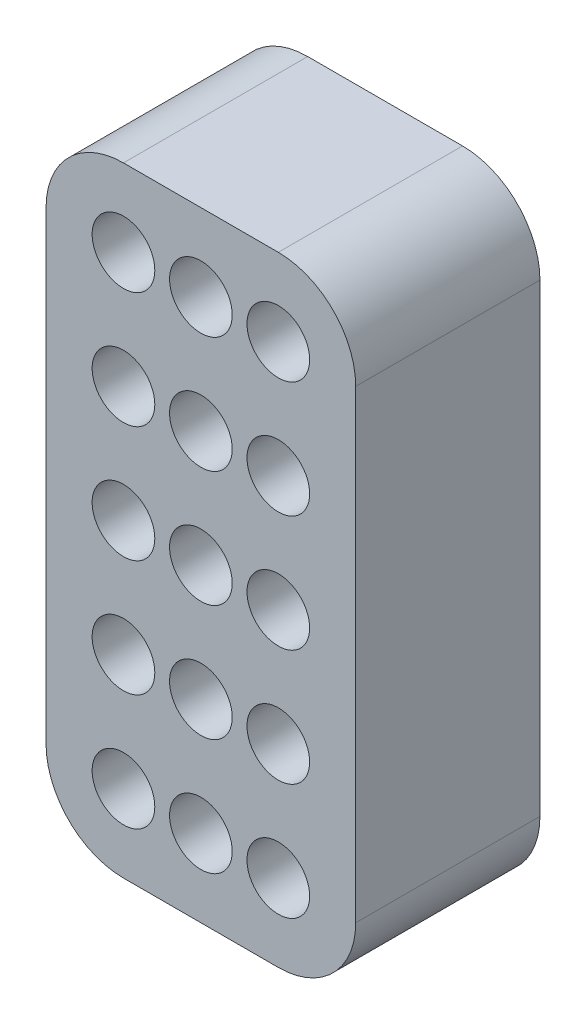
ISO-10303-21;
HEADER;
FILE_DESCRIPTION(('STEP AP214'),'2;1');
FILE_NAME('part.step','',(''),(''),'','','');
FILE_SCHEMA(('AUTOMOTIVE_DESIGN { 1 0 10303 214 1 1 1 1 }'));
ENDSEC;
DATA;
#1=APPLICATION_CONTEXT('core data for automotive mechanical design processes');
#2=APPLICATION_PROTOCOL_DEFINITION('international standard','automotive_design',2000,#1);
#3=PRODUCT_CONTEXT('',#1,'mechanical');
#4=PRODUCT('Part','Part','',(#3));
#5=PRODUCT_RELATED_PRODUCT_CATEGORY('part','',(#4));
#6=PRODUCT_DEFINITION_FORMATION('','',#4);
#7=PRODUCT_DEFINITION_CONTEXT('part definition',#1,'design');
#8=PRODUCT_DEFINITION('design','',#6,#7);
#9=PRODUCT_DEFINITION_SHAPE('','',#8);
#10=(LENGTH_UNIT() NAMED_UNIT(*) SI_UNIT(.MILLI.,.METRE.));
#11=(NAMED_UNIT(*) PLANE_ANGLE_UNIT() SI_UNIT($,.RADIAN.));
#12=(NAMED_UNIT(*) SI_UNIT($,.STERADIAN.) SOLID_ANGLE_UNIT());
#13=UNCERTAINTY_MEASURE_WITH_UNIT(LENGTH_MEASURE(1.E-05),#10,'distance_accuracy_value','');
#14=(GEOMETRIC_REPRESENTATION_CONTEXT(3) GLOBAL_UNCERTAINTY_ASSIGNED_CONTEXT((#13)) GLOBAL_UNIT_ASSIGNED_CONTEXT((#10,
#11,#12)) REPRESENTATION_CONTEXT('',''));
#15=CARTESIAN_POINT('',(0.,0.,0.));
#16=DIRECTION('',(0.,0.,1.));
#17=DIRECTION('',(1.,0.,0.));
#18=AXIS2_PLACEMENT_3D('',#15,#16,#17);
#19=CARTESIAN_POINT('',(-2.,3.,1.54945714564995));
#20=DIRECTION('',(0.,0.,-1.));
#21=DIRECTION('',(-1.,0.,0.));
#22=AXIS2_PLACEMENT_3D('',#19,#20,#21);
#23=PLANE('',#22);
#24=CARTESIAN_POINT('',(-2.,3.,1.54945714564995));
#25=DIRECTION('',(0.,0.,1.));
#26=DIRECTION('',(1.,0.,0.));
#27=AXIS2_PLACEMENT_3D('',#24,#25,#26);
#28=CIRCLE('',#27,0.809369135669028);
#29=CARTESIAN_POINT('',(-1.19063086433097,3.,1.54945714564995));
#30=VERTEX_POINT('',#29);
#31=EDGE_CURVE('E20',#30,#30,#28,.T.);
#32=ORIENTED_EDGE('',*,*,#31,.T.);
#33=EDGE_LOOP('',(#32));
#34=FACE_BOUND('',#33,.T.);
#35=ADVANCED_FACE('F17',(#34),#23,.F.);
#36=CARTESIAN_POINT('',(-2.,-3.,1.54945714564995));
#37=DIRECTION('',(0.,0.,-1.));
#38=DIRECTION('',(-1.,0.,0.));
#39=AXIS2_PLACEMENT_3D('',#36,#37,#38);
#40=PLANE('',#39);
#41=CARTESIAN_POINT('',(-2.,-3.,1.54945714564995));
#42=DIRECTION('',(0.,0.,1.));
#43=DIRECTION('',(1.,0.,0.));
#44=AXIS2_PLACEMENT_3D('',#41,#42,#43);
#45=CIRCLE('',#44,0.809369135669028);
#46=CARTESIAN_POINT('',(-1.19063086433097,-3.,1.54945714564995));
#47=VERTEX_POINT('',#46);
#48=EDGE_CURVE('E218',#47,#47,#45,.T.);
#49=ORIENTED_EDGE('',*,*,#48,.T.);
#50=EDGE_LOOP('',(#49));
#51=FACE_BOUND('',#50,.T.);
#52=ADVANCED_FACE('F341',(#51),#40,.F.);
#53=CARTESIAN_POINT('',(0.,6.,1.54945714564995));
#54=DIRECTION('',(0.,0.,-1.));
#55=DIRECTION('',(-1.,0.,0.));
#56=AXIS2_PLACEMENT_3D('',#53,#54,#55);
#57=PLANE('',#56);
#58=CARTESIAN_POINT('',(0.,6.,1.54945714564995));
#59=DIRECTION('',(0.,0.,1.));
#60=DIRECTION('',(1.,0.,0.));
#61=AXIS2_PLACEMENT_3D('',#58,#59,#60);
#62=CIRCLE('',#61,0.809369135669028);
#63=CARTESIAN_POINT('',(0.809369135669033,6.,1.54945714564995));
#64=VERTEX_POINT('',#63);
#65=EDGE_CURVE('E216',#64,#64,#62,.T.);
#66=ORIENTED_EDGE('',*,*,#65,.T.);
#67=EDGE_LOOP('',(#66));
#68=FACE_BOUND('',#67,.T.);
#69=ADVANCED_FACE('F338',(#68),#57,.F.);
#70=CARTESIAN_POINT('',(0.,0.,1.54945714564995));
#71=DIRECTION('',(0.,0.,-1.));
#72=DIRECTION('',(-1.,0.,0.));
#73=AXIS2_PLACEMENT_3D('',#70,#71,#72);
#74=PLANE('',#73);
#75=CARTESIAN_POINT('',(0.,0.,1.54945714564995));
#76=DIRECTION('',(0.,0.,1.));
#77=DIRECTION('',(1.,0.,0.));
#78=AXIS2_PLACEMENT_3D('',#75,#76,#77);
#79=CIRCLE('',#78,0.809369135669028);
#80=CARTESIAN_POINT('',(0.809369135669033,0.,1.54945714564995));
#81=VERTEX_POINT('',#80);
#82=EDGE_CURVE('E213',#81,#81,#79,.T.);
#83=ORIENTED_EDGE('',*,*,#82,.T.);
#84=EDGE_LOOP('',(#83));
#85=FACE_BOUND('',#84,.T.);
#86=ADVANCED_FACE('F340',(#85),#74,.F.);
#87=CARTESIAN_POINT('',(0.,-6.,1.54945714564995));
#88=DIRECTION('',(0.,0.,-1.));
#89=DIRECTION('',(-1.,0.,0.));
#90=AXIS2_PLACEMENT_3D('',#87,#88,#89);
#91=PLANE('',#90);
#92=CARTESIAN_POINT('',(0.,-6.,1.54945714564995));
#93=DIRECTION('',(0.,0.,1.));
#94=DIRECTION('',(1.,0.,0.));
#95=AXIS2_PLACEMENT_3D('',#92,#93,#94);
#96=CIRCLE('',#95,0.809369135669028);
#97=CARTESIAN_POINT('',(0.809369135669031,-6.,1.54945714564995));
#98=VERTEX_POINT('',#97);
#99=EDGE_CURVE('E210',#98,#98,#96,.T.);
#100=ORIENTED_EDGE('',*,*,#99,.T.);
#101=EDGE_LOOP('',(#100));
#102=FACE_BOUND('',#101,.T.);
#103=ADVANCED_FACE('F347',(#102),#91,.F.);
#104=CARTESIAN_POINT('',(2.,3.,1.54945714564995));
#105=DIRECTION('',(0.,0.,-1.));
#106=DIRECTION('',(-1.,0.,0.));
#107=AXIS2_PLACEMENT_3D('',#104,#105,#106);
#108=PLANE('',#107);
#109=CARTESIAN_POINT('',(2.,3.,1.54945714564995));
#110=DIRECTION('',(0.,0.,1.));
#111=DIRECTION('',(1.,0.,0.));
#112=AXIS2_PLACEMENT_3D('',#109,#110,#111);
#113=CIRCLE('',#112,0.809369135669028);
#114=CARTESIAN_POINT('',(2.80936913566903,3.,1.54945714564995));
#115=VERTEX_POINT('',#114);
#116=EDGE_CURVE('E207',#115,#115,#113,.T.);
#117=ORIENTED_EDGE('',*,*,#116,.T.);
#118=EDGE_LOOP('',(#117));
#119=FACE_BOUND('',#118,.T.);
#120=ADVANCED_FACE('F353',(#119),#108,.F.);
#121=CARTESIAN_POINT('',(2.,-3.,1.54945714564995));
#122=DIRECTION('',(0.,0.,-1.));
#123=DIRECTION('',(-1.,0.,0.));
#124=AXIS2_PLACEMENT_3D('',#121,#122,#123);
#125=PLANE('',#124);
#126=CARTESIAN_POINT('',(2.,-3.,1.54945714564995));
#127=DIRECTION('',(0.,0.,1.));
#128=DIRECTION('',(1.,0.,0.));
#129=AXIS2_PLACEMENT_3D('',#126,#127,#128);
#130=CIRCLE('',#129,0.809369135669028);
#131=CARTESIAN_POINT('',(2.80936913566903,-3.,1.54945714564995));
#132=VERTEX_POINT('',#131);
#133=EDGE_CURVE('E204',#132,#132,#130,.T.);
#134=ORIENTED_EDGE('',*,*,#133,.T.);
#135=EDGE_LOOP('',(#134));
#136=FACE_BOUND('',#135,.T.);
#137=ADVANCED_FACE('F357',(#136),#125,.F.);
#138=CARTESIAN_POINT('',(2.,-6.,1.54945714564995));
#139=DIRECTION('',(0.,0.,-1.));
#140=DIRECTION('',(-1.,0.,0.));
#141=AXIS2_PLACEMENT_3D('',#138,#139,#140);
#142=PLANE('',#141);
#143=CARTESIAN_POINT('',(2.,-6.,1.54945714564995));
#144=DIRECTION('',(0.,0.,1.));
#145=DIRECTION('',(1.,0.,0.));
#146=AXIS2_PLACEMENT_3D('',#143,#144,#145);
#147=CIRCLE('',#146,0.809369135669028);
#148=CARTESIAN_POINT('',(2.80936913566903,-6.,1.54945714564995));
#149=VERTEX_POINT('',#148);
#150=EDGE_CURVE('E201',#149,#149,#147,.T.);
#151=ORIENTED_EDGE('',*,*,#150,.T.);
#152=EDGE_LOOP('',(#151));
#153=FACE_BOUND('',#152,.T.);
#154=ADVANCED_FACE('F361',(#153),#142,.F.);
#155=CARTESIAN_POINT('',(2.,0.,1.54945714564995));
#156=DIRECTION('',(0.,0.,-1.));
#157=DIRECTION('',(-1.,0.,0.));
#158=AXIS2_PLACEMENT_3D('',#155,#156,#157);
#159=PLANE('',#158);
#160=CARTESIAN_POINT('',(2.,0.,1.54945714564995));
#161=DIRECTION('',(0.,0.,1.));
#162=DIRECTION('',(1.,0.,0.));
#163=AXIS2_PLACEMENT_3D('',#160,#161,#162);
#164=CIRCLE('',#163,0.809369135669028);
#165=CARTESIAN_POINT('',(2.80936913566903,0.,1.54945714564995));
#166=VERTEX_POINT('',#165);
#167=EDGE_CURVE('E198',#166,#166,#164,.T.);
#168=ORIENTED_EDGE('',*,*,#167,.T.);
#169=EDGE_LOOP('',(#168));
#170=FACE_BOUND('',#169,.T.);
#171=ADVANCED_FACE('F365',(#170),#159,.F.);
#172=CARTESIAN_POINT('',(2.,6.,1.54945714564995));
#173=DIRECTION('',(0.,0.,-1.));
#174=DIRECTION('',(-1.,0.,0.));
#175=AXIS2_PLACEMENT_3D('',#172,#173,#174);
#176=PLANE('',#175);
#177=CARTESIAN_POINT('',(2.,6.,1.54945714564995));
#178=DIRECTION('',(0.,0.,1.));
#179=DIRECTION('',(1.,0.,0.));
#180=AXIS2_PLACEMENT_3D('',#177,#178,#179);
#181=CIRCLE('',#180,0.809369135669028);
#182=CARTESIAN_POINT('',(2.80936913566903,6.,1.54945714564995));
#183=VERTEX_POINT('',#182);
#184=EDGE_CURVE('E195',#183,#183,#181,.T.);
#185=ORIENTED_EDGE('',*,*,#184,.T.);
#186=EDGE_LOOP('',(#185));
#187=FACE_BOUND('',#186,.T.);
#188=ADVANCED_FACE('F369',(#187),#176,.F.);
#189=CARTESIAN_POINT('',(0.,-3.,1.54945714564995));
#190=DIRECTION('',(0.,0.,-1.));
#191=DIRECTION('',(-1.,0.,0.));
#192=AXIS2_PLACEMENT_3D('',#189,#190,#191);
#193=PLANE('',#192);
#194=CARTESIAN_POINT('',(0.,-3.,1.54945714564995));
#195=DIRECTION('',(0.,0.,1.));
#196=DIRECTION('',(1.,0.,0.));
#197=AXIS2_PLACEMENT_3D('',#194,#195,#196);
#198=CIRCLE('',#197,0.809369135669028);
#199=CARTESIAN_POINT('',(0.809369135669033,-3.,1.54945714564995));
#200=VERTEX_POINT('',#199);
#201=EDGE_CURVE('E192',#200,#200,#198,.T.);
#202=ORIENTED_EDGE('',*,*,#201,.T.);
#203=EDGE_LOOP('',(#202));
#204=FACE_BOUND('',#203,.T.);
#205=ADVANCED_FACE('F373',(#204),#193,.F.);
#206=CARTESIAN_POINT('',(0.,3.,1.54945714564995));
#207=DIRECTION('',(0.,0.,-1.));
#208=DIRECTION('',(-1.,0.,0.));
#209=AXIS2_PLACEMENT_3D('',#206,#207,#208);
#210=PLANE('',#209);
#211=CARTESIAN_POINT('',(0.,3.,1.54945714564995));
#212=DIRECTION('',(0.,0.,1.));
#213=DIRECTION('',(1.,0.,0.));
#214=AXIS2_PLACEMENT_3D('',#211,#212,#213);
#215=CIRCLE('',#214,0.809369135669028);
#216=CARTESIAN_POINT('',(0.809369135669033,3.,1.54945714564995));
#217=VERTEX_POINT('',#216);
#218=EDGE_CURVE('E189',#217,#217,#215,.T.);
#219=ORIENTED_EDGE('',*,*,#218,.T.);
#220=EDGE_LOOP('',(#219));
#221=FACE_BOUND('',#220,.T.);
#222=ADVANCED_FACE('F377',(#221),#210,.F.);
#223=CARTESIAN_POINT('',(-2.,-6.,1.54945714564995));
#224=DIRECTION('',(0.,0.,-1.));
#225=DIRECTION('',(-1.,0.,0.));
#226=AXIS2_PLACEMENT_3D('',#223,#224,#225);
#227=PLANE('',#226);
#228=CARTESIAN_POINT('',(-2.,-6.,1.54945714564995));
#229=DIRECTION('',(0.,0.,1.));
#230=DIRECTION('',(1.,0.,0.));
#231=AXIS2_PLACEMENT_3D('',#228,#229,#230);
#232=CIRCLE('',#231,0.809369135669028);
#233=CARTESIAN_POINT('',(-1.19063086433097,-6.,1.54945714564995));
#234=VERTEX_POINT('',#233);
#235=EDGE_CURVE('E186',#234,#234,#232,.T.);
#236=ORIENTED_EDGE('',*,*,#235,.T.);
#237=EDGE_LOOP('',(#236));
#238=FACE_BOUND('',#237,.T.);
#239=ADVANCED_FACE('F381',(#238),#227,.F.);
#240=CARTESIAN_POINT('',(-2.,0.,1.54945714564995));
#241=DIRECTION('',(0.,0.,-1.));
#242=DIRECTION('',(-1.,0.,0.));
#243=AXIS2_PLACEMENT_3D('',#240,#241,#242);
#244=PLANE('',#243);
#245=CARTESIAN_POINT('',(-2.,0.,1.54945714564995));
#246=DIRECTION('',(0.,0.,1.));
#247=DIRECTION('',(1.,0.,0.));
#248=AXIS2_PLACEMENT_3D('',#245,#246,#247);
#249=CIRCLE('',#248,0.809369135669028);
#250=CARTESIAN_POINT('',(-1.19063086433097,0.,1.54945714564995));
#251=VERTEX_POINT('',#250);
#252=EDGE_CURVE('E183',#251,#251,#249,.T.);
#253=ORIENTED_EDGE('',*,*,#252,.T.);
#254=EDGE_LOOP('',(#253));
#255=FACE_BOUND('',#254,.T.);
#256=ADVANCED_FACE('F240',(#255),#244,.F.);
#257=CARTESIAN_POINT('',(-2.,6.,1.54945714564995));
#258=DIRECTION('',(0.,0.,-1.));
#259=DIRECTION('',(-1.,0.,0.));
#260=AXIS2_PLACEMENT_3D('',#257,#258,#259);
#261=PLANE('',#260);
#262=CARTESIAN_POINT('',(-2.,6.,1.54945714564995));
#263=DIRECTION('',(0.,0.,1.));
#264=DIRECTION('',(1.,0.,0.));
#265=AXIS2_PLACEMENT_3D('',#262,#263,#264);
#266=CIRCLE('',#265,0.809369135669028);
#267=CARTESIAN_POINT('',(-1.19063086433097,6.,1.54945714564995));
#268=VERTEX_POINT('',#267);
#269=EDGE_CURVE('E180',#268,#268,#266,.T.);
#270=ORIENTED_EDGE('',*,*,#269,.T.);
#271=EDGE_LOOP('',(#270));
#272=FACE_BOUND('',#271,.T.);
#273=ADVANCED_FACE('F229',(#272),#261,.F.);
#274=CARTESIAN_POINT('',(-2.,3.,1.54945714564995));
#275=DIRECTION('',(0.,0.,1.));
#276=DIRECTION('',(1.,0.,0.));
#277=AXIS2_PLACEMENT_3D('',#274,#275,#276);
#278=CYLINDRICAL_SURFACE('',#277,0.809369135669028);
#279=CARTESIAN_POINT('',(-2.,3.,4.75904305856717));
#280=DIRECTION('',(0.,0.,1.));
#281=DIRECTION('',(1.,0.,0.));
#282=AXIS2_PLACEMENT_3D('',#279,#280,#281);
#283=CIRCLE('',#282,0.809369135669028);
#284=CARTESIAN_POINT('',(-1.19063086433097,3.,4.75904305856717));
#285=VERTEX_POINT('',#284);
#286=EDGE_CURVE('E177',#285,#285,#283,.F.);
#287=ORIENTED_EDGE('',*,*,#286,.F.);
#288=EDGE_LOOP('',(#287));
#289=FACE_BOUND('',#288,.T.);
#290=ORIENTED_EDGE('',*,*,#31,.F.);
#291=EDGE_LOOP('',(#290));
#292=FACE_BOUND('',#291,.T.);
#293=ADVANCED_FACE('F226',(#289,#292),#278,.F.);
#294=CARTESIAN_POINT('',(-2.,-3.,1.54945714564995));
#295=DIRECTION('',(0.,0.,1.));
#296=DIRECTION('',(1.,0.,0.));
#297=AXIS2_PLACEMENT_3D('',#294,#295,#296);
#298=CYLINDRICAL_SURFACE('',#297,0.809369135669028);
#299=CARTESIAN_POINT('',(-2.,-3.,4.75904305856717));
#300=DIRECTION('',(0.,0.,1.));
#301=DIRECTION('',(1.,0.,0.));
#302=AXIS2_PLACEMENT_3D('',#299,#300,#301);
#303=CIRCLE('',#302,0.809369135669028);
#304=CARTESIAN_POINT('',(-1.19063086433097,-3.,4.75904305856717));
#305=VERTEX_POINT('',#304);
#306=EDGE_CURVE('E174',#305,#305,#303,.F.);
#307=ORIENTED_EDGE('',*,*,#306,.F.);
#308=EDGE_LOOP('',(#307));
#309=FACE_BOUND('',#308,.T.);
#310=ORIENTED_EDGE('',*,*,#48,.F.);
#311=EDGE_LOOP('',(#310));
#312=FACE_BOUND('',#311,.T.);
#313=ADVANCED_FACE('F228',(#309,#312),#298,.F.);
#314=CARTESIAN_POINT('',(0.,6.,1.54945714564995));
#315=DIRECTION('',(0.,0.,1.));
#316=DIRECTION('',(1.,0.,0.));
#317=AXIS2_PLACEMENT_3D('',#314,#315,#316);
#318=CYLINDRICAL_SURFACE('',#317,0.809369135669028);
#319=CARTESIAN_POINT('',(0.,6.,4.75904305856717));
#320=DIRECTION('',(0.,0.,1.));
#321=DIRECTION('',(1.,0.,0.));
#322=AXIS2_PLACEMENT_3D('',#319,#320,#321);
#323=CIRCLE('',#322,0.809369135669028);
#324=CARTESIAN_POINT('',(0.809369135669033,6.,4.75904305856717));
#325=VERTEX_POINT('',#324);
#326=EDGE_CURVE('E171',#325,#325,#323,.F.);
#327=ORIENTED_EDGE('',*,*,#326,.F.);
#328=EDGE_LOOP('',(#327));
#329=FACE_BOUND('',#328,.T.);
#330=ORIENTED_EDGE('',*,*,#65,.F.);
#331=EDGE_LOOP('',(#330));
#332=FACE_BOUND('',#331,.T.);
#333=ADVANCED_FACE('F237',(#329,#332),#318,.F.);
#334=CARTESIAN_POINT('',(0.,0.,1.54945714564995));
#335=DIRECTION('',(0.,0.,1.));
#336=DIRECTION('',(1.,0.,0.));
#337=AXIS2_PLACEMENT_3D('',#334,#335,#336);
#338=CYLINDRICAL_SURFACE('',#337,0.809369135669028);
#339=CARTESIAN_POINT('',(0.,0.,4.75904305856717));
#340=DIRECTION('',(0.,0.,1.));
#341=DIRECTION('',(1.,0.,0.));
#342=AXIS2_PLACEMENT_3D('',#339,#340,#341);
#343=CIRCLE('',#342,0.809369135669028);
#344=CARTESIAN_POINT('',(0.809369135669033,0.,4.75904305856717));
#345=VERTEX_POINT('',#344);
#346=EDGE_CURVE('E168',#345,#345,#343,.F.);
#347=ORIENTED_EDGE('',*,*,#346,.F.);
#348=EDGE_LOOP('',(#347));
#349=FACE_BOUND('',#348,.T.);
#350=ORIENTED_EDGE('',*,*,#82,.F.);
#351=EDGE_LOOP('',(#350));
#352=FACE_BOUND('',#351,.T.);
#353=ADVANCED_FACE('F325',(#349,#352),#338,.F.);
#354=CARTESIAN_POINT('',(0.,-6.,1.54945714564995));
#355=DIRECTION('',(0.,0.,1.));
#356=DIRECTION('',(1.,0.,0.));
#357=AXIS2_PLACEMENT_3D('',#354,#355,#356);
#358=CYLINDRICAL_SURFACE('',#357,0.809369135669028);
#359=CARTESIAN_POINT('',(0.,-6.,4.75904305856717));
#360=DIRECTION('',(0.,0.,1.));
#361=DIRECTION('',(1.,0.,0.));
#362=AXIS2_PLACEMENT_3D('',#359,#360,#361);
#363=CIRCLE('',#362,0.809369135669028);
#364=CARTESIAN_POINT('',(0.809369135669031,-6.,4.75904305856717));
#365=VERTEX_POINT('',#364);
#366=EDGE_CURVE('E165',#365,#365,#363,.F.);
#367=ORIENTED_EDGE('',*,*,#366,.F.);
#368=EDGE_LOOP('',(#367));
#369=FACE_BOUND('',#368,.T.);
#370=ORIENTED_EDGE('',*,*,#99,.F.);
#371=EDGE_LOOP('',(#370));
#372=FACE_BOUND('',#371,.T.);
#373=ADVANCED_FACE('F321',(#369,#372),#358,.F.);
#374=CARTESIAN_POINT('',(2.,3.,1.54945714564995));
#375=DIRECTION('',(0.,0.,1.));
#376=DIRECTION('',(1.,0.,0.));
#377=AXIS2_PLACEMENT_3D('',#374,#375,#376);
#378=CYLINDRICAL_SURFACE('',#377,0.809369135669028);
#379=CARTESIAN_POINT('',(2.,3.,4.75904305856717));
#380=DIRECTION('',(0.,0.,1.));
#381=DIRECTION('',(1.,0.,0.));
#382=AXIS2_PLACEMENT_3D('',#379,#380,#381);
#383=CIRCLE('',#382,0.809369135669028);
#384=CARTESIAN_POINT('',(2.80936913566903,3.,4.75904305856717));
#385=VERTEX_POINT('',#384);
#386=EDGE_CURVE('E162',#385,#385,#383,.F.);
#387=ORIENTED_EDGE('',*,*,#386,.F.);
#388=EDGE_LOOP('',(#387));
#389=FACE_BOUND('',#388,.T.);
#390=ORIENTED_EDGE('',*,*,#116,.F.);
#391=EDGE_LOOP('',(#390));
#392=FACE_BOUND('',#391,.T.);
#393=ADVANCED_FACE('F317',(#389,#392),#378,.F.);
#394=CARTESIAN_POINT('',(2.,-3.,1.54945714564995));
#395=DIRECTION('',(0.,0.,1.));
#396=DIRECTION('',(1.,0.,0.));
#397=AXIS2_PLACEMENT_3D('',#394,#395,#396);
#398=CYLINDRICAL_SURFACE('',#397,0.809369135669028);
#399=CARTESIAN_POINT('',(2.,-3.,4.75904305856717));
#400=DIRECTION('',(0.,0.,1.));
#401=DIRECTION('',(1.,0.,0.));
#402=AXIS2_PLACEMENT_3D('',#399,#400,#401);
#403=CIRCLE('',#402,0.809369135669028);
#404=CARTESIAN_POINT('',(2.80936913566903,-3.,4.75904305856717));
#405=VERTEX_POINT('',#404);
#406=EDGE_CURVE('E159',#405,#405,#403,.F.);
#407=ORIENTED_EDGE('',*,*,#406,.F.);
#408=EDGE_LOOP('',(#407));
#409=FACE_BOUND('',#408,.T.);
#410=ORIENTED_EDGE('',*,*,#133,.F.);
#411=EDGE_LOOP('',(#410));
#412=FACE_BOUND('',#411,.T.);
#413=ADVANCED_FACE('F313',(#409,#412),#398,.F.);
#414=CARTESIAN_POINT('',(2.,-6.,1.54945714564995));
#415=DIRECTION('',(0.,0.,1.));
#416=DIRECTION('',(1.,0.,0.));
#417=AXIS2_PLACEMENT_3D('',#414,#415,#416);
#418=CYLINDRICAL_SURFACE('',#417,0.809369135669028);
#419=CARTESIAN_POINT('',(2.,-6.,4.75904305856717));
#420=DIRECTION('',(0.,0.,1.));
#421=DIRECTION('',(1.,0.,0.));
#422=AXIS2_PLACEMENT_3D('',#419,#420,#421);
#423=CIRCLE('',#422,0.809369135669028);
#424=CARTESIAN_POINT('',(2.80936913566903,-6.,4.75904305856717));
#425=VERTEX_POINT('',#424);
#426=EDGE_CURVE('E156',#425,#425,#423,.F.);
#427=ORIENTED_EDGE('',*,*,#426,.F.);
#428=EDGE_LOOP('',(#427));
#429=FACE_BOUND('',#428,.T.);
#430=ORIENTED_EDGE('',*,*,#150,.F.);
#431=EDGE_LOOP('',(#430));
#432=FACE_BOUND('',#431,.T.);
#433=ADVANCED_FACE('F309',(#429,#432),#418,.F.);
#434=CARTESIAN_POINT('',(2.,0.,1.54945714564995));
#435=DIRECTION('',(0.,0.,1.));
#436=DIRECTION('',(1.,0.,0.));
#437=AXIS2_PLACEMENT_3D('',#434,#435,#436);
#438=CYLINDRICAL_SURFACE('',#437,0.809369135669028);
#439=CARTESIAN_POINT('',(2.,0.,4.75904305856717));
#440=DIRECTION('',(0.,0.,1.));
#441=DIRECTION('',(1.,0.,0.));
#442=AXIS2_PLACEMENT_3D('',#439,#440,#441);
#443=CIRCLE('',#442,0.809369135669028);
#444=CARTESIAN_POINT('',(2.80936913566903,0.,4.75904305856717));
#445=VERTEX_POINT('',#444);
#446=EDGE_CURVE('E153',#445,#445,#443,.F.);
#447=ORIENTED_EDGE('',*,*,#446,.F.);
#448=EDGE_LOOP('',(#447));
#449=FACE_BOUND('',#448,.T.);
#450=ORIENTED_EDGE('',*,*,#167,.F.);
#451=EDGE_LOOP('',(#450));
#452=FACE_BOUND('',#451,.T.);
#453=ADVANCED_FACE('F305',(#449,#452),#438,.F.);
#454=CARTESIAN_POINT('',(2.,6.,1.54945714564995));
#455=DIRECTION('',(0.,0.,1.));
#456=DIRECTION('',(1.,0.,0.));
#457=AXIS2_PLACEMENT_3D('',#454,#455,#456);
#458=CYLINDRICAL_SURFACE('',#457,0.809369135669028);
#459=CARTESIAN_POINT('',(2.,6.,4.75904305856717));
#460=DIRECTION('',(0.,0.,1.));
#461=DIRECTION('',(1.,0.,0.));
#462=AXIS2_PLACEMENT_3D('',#459,#460,#461);
#463=CIRCLE('',#462,0.809369135669028);
#464=CARTESIAN_POINT('',(2.80936913566903,6.,4.75904305856717));
#465=VERTEX_POINT('',#464);
#466=EDGE_CURVE('E150',#465,#465,#463,.F.);
#467=ORIENTED_EDGE('',*,*,#466,.F.);
#468=EDGE_LOOP('',(#467));
#469=FACE_BOUND('',#468,.T.);
#470=ORIENTED_EDGE('',*,*,#184,.F.);
#471=EDGE_LOOP('',(#470));
#472=FACE_BOUND('',#471,.T.);
#473=ADVANCED_FACE('F301',(#469,#472),#458,.F.);
#474=CARTESIAN_POINT('',(0.,-3.,1.54945714564995));
#475=DIRECTION('',(0.,0.,1.));
#476=DIRECTION('',(1.,0.,0.));
#477=AXIS2_PLACEMENT_3D('',#474,#475,#476);
#478=CYLINDRICAL_SURFACE('',#477,0.809369135669028);
#479=CARTESIAN_POINT('',(0.,-3.,4.75904305856717));
#480=DIRECTION('',(0.,0.,1.));
#481=DIRECTION('',(1.,0.,0.));
#482=AXIS2_PLACEMENT_3D('',#479,#480,#481);
#483=CIRCLE('',#482,0.809369135669028);
#484=CARTESIAN_POINT('',(0.809369135669033,-3.,4.75904305856717));
#485=VERTEX_POINT('',#484);
#486=EDGE_CURVE('E147',#485,#485,#483,.F.);
#487=ORIENTED_EDGE('',*,*,#486,.F.);
#488=EDGE_LOOP('',(#487));
#489=FACE_BOUND('',#488,.T.);
#490=ORIENTED_EDGE('',*,*,#201,.F.);
#491=EDGE_LOOP('',(#490));
#492=FACE_BOUND('',#491,.T.);
#493=ADVANCED_FACE('F297',(#489,#492),#478,.F.);
#494=CARTESIAN_POINT('',(0.,3.,1.54945714564995));
#495=DIRECTION('',(0.,0.,1.));
#496=DIRECTION('',(1.,0.,0.));
#497=AXIS2_PLACEMENT_3D('',#494,#495,#496);
#498=CYLINDRICAL_SURFACE('',#497,0.809369135669028);
#499=CARTESIAN_POINT('',(0.,3.,4.75904305856717));
#500=DIRECTION('',(0.,0.,1.));
#501=DIRECTION('',(1.,0.,0.));
#502=AXIS2_PLACEMENT_3D('',#499,#500,#501);
#503=CIRCLE('',#502,0.809369135669028);
#504=CARTESIAN_POINT('',(0.809369135669033,3.,4.75904305856717));
#505=VERTEX_POINT('',#504);
#506=EDGE_CURVE('E144',#505,#505,#503,.F.);
#507=ORIENTED_EDGE('',*,*,#506,.F.);
#508=EDGE_LOOP('',(#507));
#509=FACE_BOUND('',#508,.T.);
#510=ORIENTED_EDGE('',*,*,#218,.F.);
#511=EDGE_LOOP('',(#510));
#512=FACE_BOUND('',#511,.T.);
#513=ADVANCED_FACE('F293',(#509,#512),#498,.F.);
#514=CARTESIAN_POINT('',(-2.,-6.,1.54945714564995));
#515=DIRECTION('',(0.,0.,1.));
#516=DIRECTION('',(1.,0.,0.));
#517=AXIS2_PLACEMENT_3D('',#514,#515,#516);
#518=CYLINDRICAL_SURFACE('',#517,0.809369135669028);
#519=CARTESIAN_POINT('',(-2.,-6.,4.75904305856717));
#520=DIRECTION('',(0.,0.,1.));
#521=DIRECTION('',(1.,0.,0.));
#522=AXIS2_PLACEMENT_3D('',#519,#520,#521);
#523=CIRCLE('',#522,0.809369135669028);
#524=CARTESIAN_POINT('',(-1.19063086433097,-6.,4.75904305856717));
#525=VERTEX_POINT('',#524);
#526=EDGE_CURVE('E141',#525,#525,#523,.F.);
#527=ORIENTED_EDGE('',*,*,#526,.F.);
#528=EDGE_LOOP('',(#527));
#529=FACE_BOUND('',#528,.T.);
#530=ORIENTED_EDGE('',*,*,#235,.F.);
#531=EDGE_LOOP('',(#530));
#532=FACE_BOUND('',#531,.T.);
#533=ADVANCED_FACE('F289',(#529,#532),#518,.F.);
#534=CARTESIAN_POINT('',(-2.,0.,1.54945714564995));
#535=DIRECTION('',(0.,0.,1.));
#536=DIRECTION('',(1.,0.,0.));
#537=AXIS2_PLACEMENT_3D('',#534,#535,#536);
#538=CYLINDRICAL_SURFACE('',#537,0.809369135669028);
#539=CARTESIAN_POINT('',(-2.,0.,4.75904305856717));
#540=DIRECTION('',(0.,0.,1.));
#541=DIRECTION('',(1.,0.,0.));
#542=AXIS2_PLACEMENT_3D('',#539,#540,#541);
#543=CIRCLE('',#542,0.809369135669028);
#544=CARTESIAN_POINT('',(-1.19063086433097,0.,4.75904305856717));
#545=VERTEX_POINT('',#544);
#546=EDGE_CURVE('E138',#545,#545,#543,.F.);
#547=ORIENTED_EDGE('',*,*,#546,.F.);
#548=EDGE_LOOP('',(#547));
#549=FACE_BOUND('',#548,.T.);
#550=ORIENTED_EDGE('',*,*,#252,.F.);
#551=EDGE_LOOP('',(#550));
#552=FACE_BOUND('',#551,.T.);
#553=ADVANCED_FACE('F285',(#549,#552),#538,.F.);
#554=CARTESIAN_POINT('',(-2.,6.,1.54945714564995));
#555=DIRECTION('',(0.,0.,1.));
#556=DIRECTION('',(1.,0.,0.));
#557=AXIS2_PLACEMENT_3D('',#554,#555,#556);
#558=CYLINDRICAL_SURFACE('',#557,0.809369135669028);
#559=CARTESIAN_POINT('',(-2.,6.,4.75904305856717));
#560=DIRECTION('',(0.,0.,1.));
#561=DIRECTION('',(1.,0.,0.));
#562=AXIS2_PLACEMENT_3D('',#559,#560,#561);
#563=CIRCLE('',#562,0.809369135669028);
#564=CARTESIAN_POINT('',(-1.19063086433097,6.,4.75904305856717));
#565=VERTEX_POINT('',#564);
#566=EDGE_CURVE('E93',#565,#565,#563,.F.);
#567=ORIENTED_EDGE('',*,*,#566,.F.);
#568=EDGE_LOOP('',(#567));
#569=FACE_BOUND('',#568,.T.);
#570=ORIENTED_EDGE('',*,*,#269,.F.);
#571=EDGE_LOOP('',(#570));
#572=FACE_BOUND('',#571,.T.);
#573=ADVANCED_FACE('F281',(#569,#572),#558,.F.);
#574=CARTESIAN_POINT('',(-4.,-8.,4.75904305856718));
#575=DIRECTION('',(0.,0.,1.));
#576=DIRECTION('',(1.,0.,0.));
#577=AXIS2_PLACEMENT_3D('',#574,#575,#576);
#578=PLANE('',#577);
#579=ORIENTED_EDGE('',*,*,#566,.T.);
#580=EDGE_LOOP('',(#579));
#581=FACE_BOUND('',#580,.T.);
#582=ORIENTED_EDGE('',*,*,#546,.T.);
#583=EDGE_LOOP('',(#582));
#584=FACE_BOUND('',#583,.T.);
#585=ORIENTED_EDGE('',*,*,#526,.T.);
#586=EDGE_LOOP('',(#585));
#587=FACE_BOUND('',#586,.T.);
#588=ORIENTED_EDGE('',*,*,#506,.T.);
#589=EDGE_LOOP('',(#588));
#590=FACE_BOUND('',#589,.T.);
#591=ORIENTED_EDGE('',*,*,#486,.T.);
#592=EDGE_LOOP('',(#591));
#593=FACE_BOUND('',#592,.T.);
#594=ORIENTED_EDGE('',*,*,#466,.T.);
#595=EDGE_LOOP('',(#594));
#596=FACE_BOUND('',#595,.T.);
#597=ORIENTED_EDGE('',*,*,#446,.T.);
#598=EDGE_LOOP('',(#597));
#599=FACE_BOUND('',#598,.T.);
#600=ORIENTED_EDGE('',*,*,#426,.T.);
#601=EDGE_LOOP('',(#600));
#602=FACE_BOUND('',#601,.T.);
#603=DIRECTION('',(1.,0.,0.));
#604=VECTOR('',#603,1.);
#605=CARTESIAN_POINT('',(-4.,-8.,4.75904305856718));
#606=LINE('',#605,#604);
#607=CARTESIAN_POINT('',(-2.,-8.,4.75904305856718));
#608=VERTEX_POINT('',#607);
#609=CARTESIAN_POINT('',(2.,-8.,4.75904305856718));
#610=VERTEX_POINT('',#609);
#611=EDGE_CURVE('E115',#608,#610,#606,.T.);
#612=ORIENTED_EDGE('',*,*,#611,.T.);
#613=CARTESIAN_POINT('',(2.,-6.,4.75904305856718));
#614=DIRECTION('',(0.,0.,-1.));
#615=DIRECTION('',(-1.,0.,0.));
#616=AXIS2_PLACEMENT_3D('',#613,#614,#615);
#617=CIRCLE('',#616,2.);
#618=CARTESIAN_POINT('',(4.,-6.,4.75904305856718));
#619=VERTEX_POINT('',#618);
#620=EDGE_CURVE('E116',#619,#610,#617,.T.);
#621=ORIENTED_EDGE('',*,*,#620,.F.);
#622=DIRECTION('',(0.,1.,0.));
#623=VECTOR('',#622,1.);
#624=CARTESIAN_POINT('',(4.,-8.,4.75904305856718));
#625=LINE('',#624,#623);
#626=CARTESIAN_POINT('',(4.,6.,4.75904305856718));
#627=VERTEX_POINT('',#626);
#628=EDGE_CURVE('E110',#619,#627,#625,.T.);
#629=ORIENTED_EDGE('',*,*,#628,.T.);
#630=CARTESIAN_POINT('',(2.,6.,4.75904305856718));
#631=DIRECTION('',(0.,0.,-1.));
#632=DIRECTION('',(-1.,0.,0.));
#633=AXIS2_PLACEMENT_3D('',#630,#631,#632);
#634=CIRCLE('',#633,2.);
#635=CARTESIAN_POINT('',(2.,8.,4.75904305856718));
#636=VERTEX_POINT('',#635);
#637=EDGE_CURVE('E113',#636,#627,#634,.T.);
#638=ORIENTED_EDGE('',*,*,#637,.F.);
#639=DIRECTION('',(1.,0.,0.));
#640=VECTOR('',#639,1.);
#641=CARTESIAN_POINT('',(4.,8.,4.75904305856718));
#642=LINE('',#641,#640);
#643=CARTESIAN_POINT('',(-2.,8.,4.75904305856718));
#644=VERTEX_POINT('',#643);
#645=EDGE_CURVE('E87',#636,#644,#642,.F.);
#646=ORIENTED_EDGE('',*,*,#645,.T.);
#647=CARTESIAN_POINT('',(-2.,6.,4.75904305856718));
#648=DIRECTION('',(0.,0.,-1.));
#649=DIRECTION('',(-1.,0.,0.));
#650=AXIS2_PLACEMENT_3D('',#647,#648,#649);
#651=CIRCLE('',#650,2.);
#652=CARTESIAN_POINT('',(-4.,6.,4.75904305856718));
#653=VERTEX_POINT('',#652);
#654=EDGE_CURVE('E80',#653,#644,#651,.T.);
#655=ORIENTED_EDGE('',*,*,#654,.F.);
#656=DIRECTION('',(0.,1.,0.));
#657=VECTOR('',#656,1.);
#658=CARTESIAN_POINT('',(-4.,8.,4.75904305856718));
#659=LINE('',#658,#657);
#660=CARTESIAN_POINT('',(-4.,-6.,4.75904305856718));
#661=VERTEX_POINT('',#660);
#662=EDGE_CURVE('E85',#653,#661,#659,.F.);
#663=ORIENTED_EDGE('',*,*,#662,.T.);
#664=CARTESIAN_POINT('',(-2.,-6.,4.75904305856718));
#665=DIRECTION('',(0.,0.,-1.));
#666=DIRECTION('',(-1.,0.,0.));
#667=AXIS2_PLACEMENT_3D('',#664,#665,#666);
#668=CIRCLE('',#667,2.);
#669=EDGE_CURVE('E100',#608,#661,#668,.T.);
#670=ORIENTED_EDGE('',*,*,#669,.F.);
#671=EDGE_LOOP('',(#612,#621,#629,#638,#646,#655,#663,#670));
#672=FACE_BOUND('',#671,.T.);
#673=ORIENTED_EDGE('',*,*,#406,.T.);
#674=EDGE_LOOP('',(#673));
#675=FACE_BOUND('',#674,.T.);
#676=ORIENTED_EDGE('',*,*,#386,.T.);
#677=EDGE_LOOP('',(#676));
#678=FACE_BOUND('',#677,.T.);
#679=ORIENTED_EDGE('',*,*,#366,.T.);
#680=EDGE_LOOP('',(#679));
#681=FACE_BOUND('',#680,.T.);
#682=ORIENTED_EDGE('',*,*,#346,.T.);
#683=EDGE_LOOP('',(#682));
#684=FACE_BOUND('',#683,.T.);
#685=ORIENTED_EDGE('',*,*,#326,.T.);
#686=EDGE_LOOP('',(#685));
#687=FACE_BOUND('',#686,.T.);
#688=ORIENTED_EDGE('',*,*,#306,.T.);
#689=EDGE_LOOP('',(#688));
#690=FACE_BOUND('',#689,.T.);
#691=ORIENTED_EDGE('',*,*,#286,.T.);
#692=EDGE_LOOP('',(#691));
#693=FACE_BOUND('',#692,.T.);
#694=ADVANCED_FACE('F83',(#581,#584,#587,#590,#593,#596,#599,#602,#672,#675,#678,#681,#684,#687,
#690,#693),#578,.T.);
#695=CARTESIAN_POINT('',(-2.,6.,4.75904305856718));
#696=DIRECTION('',(0.,0.,-1.));
#697=DIRECTION('',(-1.,0.,0.));
#698=AXIS2_PLACEMENT_3D('',#695,#696,#697);
#699=CYLINDRICAL_SURFACE('',#698,2.);
#700=CARTESIAN_POINT('',(-2.,6.,0.));
#701=DIRECTION('',(0.,0.,-1.));
#702=DIRECTION('',(-1.,0.,0.));
#703=AXIS2_PLACEMENT_3D('',#700,#701,#702);
#704=CIRCLE('',#703,2.);
#705=CARTESIAN_POINT('',(-2.,8.,0.));
#706=VERTEX_POINT('',#705);
#707=CARTESIAN_POINT('',(-4.,6.,0.));
#708=VERTEX_POINT('',#707);
#709=EDGE_CURVE('E104',#706,#708,#704,.F.);
#710=ORIENTED_EDGE('',*,*,#709,.T.);
#711=DIRECTION('',(0.,0.,-1.));
#712=VECTOR('',#711,1.);
#713=CARTESIAN_POINT('',(-4.,6.,4.75904305856718));
#714=LINE('',#713,#712);
#715=EDGE_CURVE('E92',#708,#653,#714,.F.);
#716=ORIENTED_EDGE('',*,*,#715,.T.);
#717=ORIENTED_EDGE('',*,*,#654,.T.);
#718=DIRECTION('',(0.,0.,-1.));
#719=VECTOR('',#718,1.);
#720=CARTESIAN_POINT('',(-2.,8.,4.75904305856718));
#721=LINE('',#720,#719);
#722=EDGE_CURVE('E771',#644,#706,#721,.T.);
#723=ORIENTED_EDGE('',*,*,#722,.T.);
#724=EDGE_LOOP('',(#710,#716,#717,#723));
#725=FACE_BOUND('',#724,.T.);
#726=ADVANCED_FACE('F103',(#725),#699,.T.);
#727=CARTESIAN_POINT('',(-4.,8.,4.75904305856718));
#728=DIRECTION('',(1.,0.,0.));
#729=DIRECTION('',(0.,0.,-1.));
#730=AXIS2_PLACEMENT_3D('',#727,#728,#729);
#731=PLANE('',#730);
#732=ORIENTED_EDGE('',*,*,#715,.F.);
#733=DIRECTION('',(0.,1.,0.));
#734=VECTOR('',#733,1.);
#735=CARTESIAN_POINT('',(-4.,-8.,0.));
#736=LINE('',#735,#734);
#737=CARTESIAN_POINT('',(-4.,-6.,0.));
#738=VERTEX_POINT('',#737);
#739=EDGE_CURVE('E129',#708,#738,#736,.F.);
#740=ORIENTED_EDGE('',*,*,#739,.T.);
#741=DIRECTION('',(0.,0.,-1.));
#742=VECTOR('',#741,1.);
#743=CARTESIAN_POINT('',(-4.,-6.,4.75904305856718));
#744=LINE('',#743,#742);
#745=EDGE_CURVE('E99',#661,#738,#744,.T.);
#746=ORIENTED_EDGE('',*,*,#745,.F.);
#747=ORIENTED_EDGE('',*,*,#662,.F.);
#748=EDGE_LOOP('',(#732,#740,#746,#747));
#749=FACE_BOUND('',#748,.T.);
#750=ADVANCED_FACE('F96',(#749),#731,.F.);
#751=CARTESIAN_POINT('',(-2.,-6.,4.75904305856718));
#752=DIRECTION('',(0.,0.,-1.));
#753=DIRECTION('',(-1.,0.,0.));
#754=AXIS2_PLACEMENT_3D('',#751,#752,#753);
#755=CYLINDRICAL_SURFACE('',#754,2.);
#756=CARTESIAN_POINT('',(-2.,-6.,0.));
#757=DIRECTION('',(0.,0.,-1.));
#758=DIRECTION('',(-1.,0.,0.));
#759=AXIS2_PLACEMENT_3D('',#756,#757,#758);
#760=CIRCLE('',#759,2.);
#761=CARTESIAN_POINT('',(-2.,-8.,0.));
#762=VERTEX_POINT('',#761);
#763=EDGE_CURVE('E126',#738,#762,#760,.F.);
#764=ORIENTED_EDGE('',*,*,#763,.T.);
#765=DIRECTION('',(0.,0.,1.));
#766=VECTOR('',#765,1.);
#767=CARTESIAN_POINT('',(-2.,-8.,4.75904305856718));
#768=LINE('',#767,#766);
#769=EDGE_CURVE('E117',#762,#608,#768,.T.);
#770=ORIENTED_EDGE('',*,*,#769,.T.);
#771=ORIENTED_EDGE('',*,*,#669,.T.);
#772=ORIENTED_EDGE('',*,*,#745,.T.);
#773=EDGE_LOOP('',(#764,#770,#771,#772));
#774=FACE_BOUND('',#773,.T.);
#775=ADVANCED_FACE('F270',(#774),#755,.T.);
#776=CARTESIAN_POINT('',(-4.,-8.,4.75904305856718));
#777=DIRECTION('',(0.,1.,0.));
#778=DIRECTION('',(0.,0.,1.));
#779=AXIS2_PLACEMENT_3D('',#776,#777,#778);
#780=PLANE('',#779);
#781=ORIENTED_EDGE('',*,*,#769,.F.);
#782=DIRECTION('',(1.,0.,0.));
#783=VECTOR('',#782,1.);
#784=CARTESIAN_POINT('',(-4.,-8.,0.));
#785=LINE('',#784,#783);
#786=CARTESIAN_POINT('',(2.,-8.,0.));
#787=VERTEX_POINT('',#786);
#788=EDGE_CURVE('E125',#762,#787,#785,.T.);
#789=ORIENTED_EDGE('',*,*,#788,.T.);
#790=DIRECTION('',(0.,0.,-1.));
#791=VECTOR('',#790,1.);
#792=CARTESIAN_POINT('',(2.,-8.,4.75904305856718));
#793=LINE('',#792,#791);
#794=EDGE_CURVE('E134',#610,#787,#793,.T.);
#795=ORIENTED_EDGE('',*,*,#794,.F.);
#796=ORIENTED_EDGE('',*,*,#611,.F.);
#797=EDGE_LOOP('',(#781,#789,#795,#796));
#798=FACE_BOUND('',#797,.T.);
#799=ADVANCED_FACE('F266',(#798),#780,.F.);
#800=CARTESIAN_POINT('',(2.,-6.,4.75904305856718));
#801=DIRECTION('',(0.,0.,-1.));
#802=DIRECTION('',(-1.,0.,0.));
#803=AXIS2_PLACEMENT_3D('',#800,#801,#802);
#804=CYLINDRICAL_SURFACE('',#803,2.);
#805=CARTESIAN_POINT('',(2.,-6.,0.));
#806=DIRECTION('',(0.,0.,-1.));
#807=DIRECTION('',(-1.,0.,0.));
#808=AXIS2_PLACEMENT_3D('',#805,#806,#807);
#809=CIRCLE('',#808,2.);
#810=CARTESIAN_POINT('',(4.,-6.,0.));
#811=VERTEX_POINT('',#810);
#812=EDGE_CURVE('E122',#787,#811,#809,.F.);
#813=ORIENTED_EDGE('',*,*,#812,.T.);
#814=DIRECTION('',(0.,0.,1.));
#815=VECTOR('',#814,1.);
#816=CARTESIAN_POINT('',(4.,-6.,4.75904305856718));
#817=LINE('',#816,#815);
#818=EDGE_CURVE('E114',#811,#619,#817,.T.);
#819=ORIENTED_EDGE('',*,*,#818,.T.);
#820=ORIENTED_EDGE('',*,*,#620,.T.);
#821=ORIENTED_EDGE('',*,*,#794,.T.);
#822=EDGE_LOOP('',(#813,#819,#820,#821));
#823=FACE_BOUND('',#822,.T.);
#824=ADVANCED_FACE('F262',(#823),#804,.T.);
#825=CARTESIAN_POINT('',(4.,-8.,4.75904305856718));
#826=DIRECTION('',(-1.,0.,0.));
#827=DIRECTION('',(0.,0.,1.));
#828=AXIS2_PLACEMENT_3D('',#825,#826,#827);
#829=PLANE('',#828);
#830=DIRECTION('',(0.,0.,-1.));
#831=VECTOR('',#830,1.);
#832=CARTESIAN_POINT('',(4.,6.,4.75904305856718));
#833=LINE('',#832,#831);
#834=CARTESIAN_POINT('',(4.,6.,0.));
#835=VERTEX_POINT('',#834);
#836=EDGE_CURVE('E132',#627,#835,#833,.T.);
#837=ORIENTED_EDGE('',*,*,#836,.F.);
#838=ORIENTED_EDGE('',*,*,#628,.F.);
#839=ORIENTED_EDGE('',*,*,#818,.F.);
#840=DIRECTION('',(0.,1.,0.));
#841=VECTOR('',#840,1.);
#842=CARTESIAN_POINT('',(4.,-8.,0.));
#843=LINE('',#842,#841);
#844=EDGE_CURVE('E121',#811,#835,#843,.T.);
#845=ORIENTED_EDGE('',*,*,#844,.T.);
#846=EDGE_LOOP('',(#837,#838,#839,#845));
#847=FACE_BOUND('',#846,.T.);
#848=ADVANCED_FACE('F258',(#847),#829,.F.);
#849=CARTESIAN_POINT('',(2.,6.,4.75904305856718));
#850=DIRECTION('',(0.,0.,-1.));
#851=DIRECTION('',(-1.,0.,0.));
#852=AXIS2_PLACEMENT_3D('',#849,#850,#851);
#853=CYLINDRICAL_SURFACE('',#852,2.);
#854=CARTESIAN_POINT('',(2.,6.,0.));
#855=DIRECTION('',(0.,0.,-1.));
#856=DIRECTION('',(-1.,0.,0.));
#857=AXIS2_PLACEMENT_3D('',#854,#855,#856);
#858=CIRCLE('',#857,2.);
#859=CARTESIAN_POINT('',(2.,8.,0.));
#860=VERTEX_POINT('',#859);
#861=EDGE_CURVE('E26',#835,#860,#858,.F.);
#862=ORIENTED_EDGE('',*,*,#861,.T.);
#863=DIRECTION('',(0.,0.,-1.));
#864=VECTOR('',#863,1.);
#865=CARTESIAN_POINT('',(2.,8.,4.75904305856718));
#866=LINE('',#865,#864);
#867=EDGE_CURVE('E34',#860,#636,#866,.F.);
#868=ORIENTED_EDGE('',*,*,#867,.T.);
#869=ORIENTED_EDGE('',*,*,#637,.T.);
#870=ORIENTED_EDGE('',*,*,#836,.T.);
#871=EDGE_LOOP('',(#862,#868,#869,#870));
#872=FACE_BOUND('',#871,.T.);
#873=ADVANCED_FACE('F252',(#872),#853,.T.);
#874=CARTESIAN_POINT('',(4.,8.,4.75904305856718));
#875=DIRECTION('',(0.,-1.,0.));
#876=DIRECTION('',(0.,0.,-1.));
#877=AXIS2_PLACEMENT_3D('',#874,#875,#876);
#878=PLANE('',#877);
#879=ORIENTED_EDGE('',*,*,#867,.F.);
#880=DIRECTION('',(1.,0.,0.));
#881=VECTOR('',#880,1.);
#882=CARTESIAN_POINT('',(-4.,8.,0.));
#883=LINE('',#882,#881);
#884=EDGE_CURVE('E11',#860,#706,#883,.F.);
#885=ORIENTED_EDGE('',*,*,#884,.T.);
#886=ORIENTED_EDGE('',*,*,#722,.F.);
#887=ORIENTED_EDGE('',*,*,#645,.F.);
#888=EDGE_LOOP('',(#879,#885,#886,#887));
#889=FACE_BOUND('',#888,.T.);
#890=ADVANCED_FACE('F246',(#889),#878,.F.);
#891=CARTESIAN_POINT('',(-4.,-8.,0.));
#892=DIRECTION('',(0.,0.,1.));
#893=DIRECTION('',(1.,0.,0.));
#894=AXIS2_PLACEMENT_3D('',#891,#892,#893);
#895=PLANE('',#894);
#896=ORIENTED_EDGE('',*,*,#861,.F.);
#897=ORIENTED_EDGE('',*,*,#844,.F.);
#898=ORIENTED_EDGE('',*,*,#812,.F.);
#899=ORIENTED_EDGE('',*,*,#788,.F.);
#900=ORIENTED_EDGE('',*,*,#763,.F.);
#901=ORIENTED_EDGE('',*,*,#739,.F.);
#902=ORIENTED_EDGE('',*,*,#709,.F.);
#903=ORIENTED_EDGE('',*,*,#884,.F.);
#904=EDGE_LOOP('',(#896,#897,#898,#899,#900,#901,#902,#903));
#905=FACE_BOUND('',#904,.T.);
#906=ADVANCED_FACE('F244',(#905),#895,.F.);
#907=CLOSED_SHELL('',(#35,#52,#69,#86,#103,#120,#137,#154,#171,#188,#205,#222,#239,#256,#273,
#293,#313,#333,#353,#373,#393,#413,#433,#453,#473,#493,#513,#533,#553,#573,#694,#726,#750,#775,
#799,#824,#848,#873,#890,#906));
#908=MANIFOLD_SOLID_BREP('B1',#907);
#909=ADVANCED_BREP_SHAPE_REPRESENTATION('',(#18,#908),#14);
#910=SHAPE_DEFINITION_REPRESENTATION(#9,#909);
ENDSEC;
END-ISO-10303-21;
